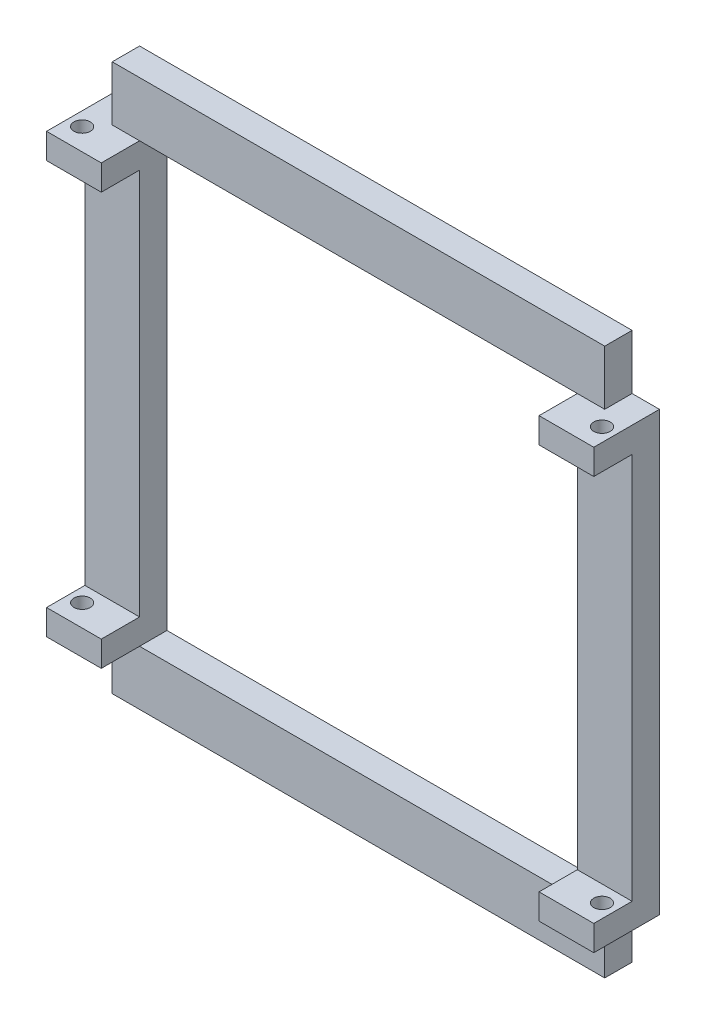
ISO-10303-21;
HEADER;
FILE_DESCRIPTION(('STEP AP214'),'2;1');
FILE_NAME('part.step','',(''),(''),'','','');
FILE_SCHEMA(('AUTOMOTIVE_DESIGN { 1 0 10303 214 1 1 1 1 }'));
ENDSEC;
DATA;
#1=APPLICATION_CONTEXT('core data for automotive mechanical design processes');
#2=APPLICATION_PROTOCOL_DEFINITION('international standard','automotive_design',2000,#1);
#3=PRODUCT_CONTEXT('',#1,'mechanical');
#4=PRODUCT('Part','Part','',(#3));
#5=PRODUCT_RELATED_PRODUCT_CATEGORY('part','',(#4));
#6=PRODUCT_DEFINITION_FORMATION('','',#4);
#7=PRODUCT_DEFINITION_CONTEXT('part definition',#1,'design');
#8=PRODUCT_DEFINITION('design','',#6,#7);
#9=PRODUCT_DEFINITION_SHAPE('','',#8);
#10=(LENGTH_UNIT() NAMED_UNIT(*) SI_UNIT(.MILLI.,.METRE.));
#11=(NAMED_UNIT(*) PLANE_ANGLE_UNIT() SI_UNIT($,.RADIAN.));
#12=(NAMED_UNIT(*) SI_UNIT($,.STERADIAN.) SOLID_ANGLE_UNIT());
#13=UNCERTAINTY_MEASURE_WITH_UNIT(LENGTH_MEASURE(1.E-05),#10,'distance_accuracy_value','');
#14=(GEOMETRIC_REPRESENTATION_CONTEXT(3) GLOBAL_UNCERTAINTY_ASSIGNED_CONTEXT((#13)) GLOBAL_UNIT_ASSIGNED_CONTEXT((#10,
#11,#12)) REPRESENTATION_CONTEXT('',''));
#15=CARTESIAN_POINT('',(0.,0.,0.));
#16=DIRECTION('',(0.,0.,1.));
#17=DIRECTION('',(1.,0.,0.));
#18=AXIS2_PLACEMENT_3D('',#15,#16,#17);
#19=CARTESIAN_POINT('',(0.,0.,5.));
#20=DIRECTION('',(0.,0.,1.));
#21=DIRECTION('',(1.,0.,0.));
#22=AXIS2_PLACEMENT_3D('',#19,#20,#21);
#23=PLANE('',#22);
#24=DIRECTION('',(-1.,0.,0.));
#25=VECTOR('',#24,1.);
#26=CARTESIAN_POINT('',(-40.,40.,5.));
#27=LINE('',#26,#25);
#28=CARTESIAN_POINT('',(40.,40.,5.));
#29=VERTEX_POINT('',#28);
#30=CARTESIAN_POINT('',(-40.,40.0000000000001,5.));
#31=VERTEX_POINT('',#30);
#32=EDGE_CURVE('E488',#29,#31,#27,.T.);
#33=ORIENTED_EDGE('',*,*,#32,.F.);
#34=DIRECTION('',(-1.,0.,0.));
#35=VECTOR('',#34,1.);
#36=CARTESIAN_POINT('',(50.,40.0000000000001,5.));
#37=LINE('',#36,#35);
#38=CARTESIAN_POINT('',(45.,40.0000000000001,5.));
#39=VERTEX_POINT('',#38);
#40=EDGE_CURVE('E231',#39,#29,#37,.T.);
#41=ORIENTED_EDGE('',*,*,#40,.F.);
#42=DIRECTION('',(0.,1.,0.));
#43=VECTOR('',#42,1.);
#44=CARTESIAN_POINT('',(45.,40.0000000000001,5.));
#45=LINE('',#44,#43);
#46=CARTESIAN_POINT('',(45.,50.,5.));
#47=VERTEX_POINT('',#46);
#48=EDGE_CURVE('E245',#39,#47,#45,.T.);
#49=ORIENTED_EDGE('',*,*,#48,.T.);
#50=DIRECTION('',(-1.,0.,0.));
#51=VECTOR('',#50,1.);
#52=CARTESIAN_POINT('',(45.,50.,5.));
#53=LINE('',#52,#51);
#54=CARTESIAN_POINT('',(-45.,50.,5.));
#55=VERTEX_POINT('',#54);
#56=EDGE_CURVE('E250',#47,#55,#53,.T.);
#57=ORIENTED_EDGE('',*,*,#56,.T.);
#58=DIRECTION('',(0.,-1.,0.));
#59=VECTOR('',#58,1.);
#60=CARTESIAN_POINT('',(-45.,40.0000000000001,5.));
#61=LINE('',#60,#59);
#62=CARTESIAN_POINT('',(-45.,40.0000000000001,5.));
#63=VERTEX_POINT('',#62);
#64=EDGE_CURVE('E258',#55,#63,#61,.T.);
#65=ORIENTED_EDGE('',*,*,#64,.T.);
#66=DIRECTION('',(-1.,0.,0.));
#67=VECTOR('',#66,1.);
#68=CARTESIAN_POINT('',(-50.,40.0000000000001,5.));
#69=LINE('',#68,#67);
#70=EDGE_CURVE('E406',#31,#63,#69,.T.);
#71=ORIENTED_EDGE('',*,*,#70,.F.);
#72=EDGE_LOOP('',(#33,#41,#49,#57,#65,#71));
#73=FACE_BOUND('',#72,.T.);
#74=ADVANCED_FACE('F43',(#73),#23,.T.);
#75=DIRECTION('',(0.,1.,0.));
#76=VECTOR('',#75,1.);
#77=CARTESIAN_POINT('',(50.,40.0000000000001,5.));
#78=LINE('',#77,#76);
#79=CARTESIAN_POINT('',(50.,-35.3623650712361,5.));
#80=VERTEX_POINT('',#79);
#81=CARTESIAN_POINT('',(50.,35.3623650712361,5.));
#82=VERTEX_POINT('',#81);
#83=EDGE_CURVE('E237',#80,#82,#78,.T.);
#84=ORIENTED_EDGE('',*,*,#83,.T.);
#85=DIRECTION('',(1.,0.,0.));
#86=VECTOR('',#85,1.);
#87=CARTESIAN_POINT('',(50.,35.3623650712361,5.));
#88=LINE('',#87,#86);
#89=CARTESIAN_POINT('',(40.,35.3623650712361,5.));
#90=VERTEX_POINT('',#89);
#91=EDGE_CURVE('E221',#90,#82,#88,.T.);
#92=ORIENTED_EDGE('',*,*,#91,.F.);
#93=DIRECTION('',(0.,1.,0.));
#94=VECTOR('',#93,1.);
#95=CARTESIAN_POINT('',(40.,40.,5.));
#96=LINE('',#95,#94);
#97=CARTESIAN_POINT('',(40.,-35.3623650712361,5.));
#98=VERTEX_POINT('',#97);
#99=EDGE_CURVE('E485',#98,#90,#96,.T.);
#100=ORIENTED_EDGE('',*,*,#99,.F.);
#101=DIRECTION('',(-1.,0.,0.));
#102=VECTOR('',#101,1.);
#103=CARTESIAN_POINT('',(50.,-35.3623650712361,5.));
#104=LINE('',#103,#102);
#105=EDGE_CURVE('E69',#80,#98,#104,.T.);
#106=ORIENTED_EDGE('',*,*,#105,.F.);
#107=EDGE_LOOP('',(#84,#92,#100,#106));
#108=FACE_BOUND('',#107,.T.);
#109=ADVANCED_FACE('F243',(#108),#23,.T.);
#110=DIRECTION('',(0.,-1.,0.));
#111=VECTOR('',#110,1.);
#112=CARTESIAN_POINT('',(-40.,40.,5.));
#113=LINE('',#112,#111);
#114=CARTESIAN_POINT('',(-40.,35.3623650712361,5.));
#115=VERTEX_POINT('',#114);
#116=CARTESIAN_POINT('',(-40.,-35.3623650712361,5.));
#117=VERTEX_POINT('',#116);
#118=EDGE_CURVE('E493',#115,#117,#113,.T.);
#119=ORIENTED_EDGE('',*,*,#118,.F.);
#120=DIRECTION('',(1.,0.,0.));
#121=VECTOR('',#120,1.);
#122=CARTESIAN_POINT('',(-50.,35.3623650712361,5.));
#123=LINE('',#122,#121);
#124=CARTESIAN_POINT('',(-50.,35.3623650712361,5.));
#125=VERTEX_POINT('',#124);
#126=EDGE_CURVE('E403',#125,#115,#123,.T.);
#127=ORIENTED_EDGE('',*,*,#126,.F.);
#128=DIRECTION('',(0.,-1.,0.));
#129=VECTOR('',#128,1.);
#130=CARTESIAN_POINT('',(-50.,40.0000000000001,5.));
#131=LINE('',#130,#129);
#132=CARTESIAN_POINT('',(-50.,-35.3623650712361,5.));
#133=VERTEX_POINT('',#132);
#134=EDGE_CURVE('E301',#125,#133,#131,.T.);
#135=ORIENTED_EDGE('',*,*,#134,.T.);
#136=DIRECTION('',(-1.,0.,0.));
#137=VECTOR('',#136,1.);
#138=CARTESIAN_POINT('',(-50.,-35.3623650712361,5.));
#139=LINE('',#138,#137);
#140=EDGE_CURVE('E433',#117,#133,#139,.T.);
#141=ORIENTED_EDGE('',*,*,#140,.F.);
#142=EDGE_LOOP('',(#119,#127,#135,#141));
#143=FACE_BOUND('',#142,.T.);
#144=ADVANCED_FACE('F603',(#143),#23,.T.);
#145=DIRECTION('',(1.,0.,0.));
#146=VECTOR('',#145,1.);
#147=CARTESIAN_POINT('',(-40.,-40.,5.));
#148=LINE('',#147,#146);
#149=CARTESIAN_POINT('',(-40.,-40.,5.));
#150=VERTEX_POINT('',#149);
#151=CARTESIAN_POINT('',(40.,-40.,5.));
#152=VERTEX_POINT('',#151);
#153=EDGE_CURVE('E496',#150,#152,#148,.T.);
#154=ORIENTED_EDGE('',*,*,#153,.F.);
#155=DIRECTION('',(1.,0.,0.));
#156=VECTOR('',#155,1.);
#157=CARTESIAN_POINT('',(-50.,-40.0000000000001,5.));
#158=LINE('',#157,#156);
#159=CARTESIAN_POINT('',(-45.,-40.0000000000001,5.));
#160=VERTEX_POINT('',#159);
#161=EDGE_CURVE('E437',#160,#150,#158,.T.);
#162=ORIENTED_EDGE('',*,*,#161,.F.);
#163=DIRECTION('',(0.,-1.,0.));
#164=VECTOR('',#163,1.);
#165=CARTESIAN_POINT('',(-45.,-40.0000000000001,5.));
#166=LINE('',#165,#164);
#167=CARTESIAN_POINT('',(-45.,-50.,5.));
#168=VERTEX_POINT('',#167);
#169=EDGE_CURVE('E529',#160,#168,#166,.T.);
#170=ORIENTED_EDGE('',*,*,#169,.T.);
#171=DIRECTION('',(1.,0.,0.));
#172=VECTOR('',#171,1.);
#173=CARTESIAN_POINT('',(45.,-50.,5.));
#174=LINE('',#173,#172);
#175=CARTESIAN_POINT('',(45.,-50.,5.));
#176=VERTEX_POINT('',#175);
#177=EDGE_CURVE('E252',#168,#176,#174,.T.);
#178=ORIENTED_EDGE('',*,*,#177,.T.);
#179=DIRECTION('',(0.,1.,0.));
#180=VECTOR('',#179,1.);
#181=CARTESIAN_POINT('',(45.,-40.0000000000001,5.));
#182=LINE('',#181,#180);
#183=CARTESIAN_POINT('',(45.,-40.0000000000001,5.));
#184=VERTEX_POINT('',#183);
#185=EDGE_CURVE('E246',#176,#184,#182,.T.);
#186=ORIENTED_EDGE('',*,*,#185,.T.);
#187=DIRECTION('',(1.,0.,0.));
#188=VECTOR('',#187,1.);
#189=CARTESIAN_POINT('',(50.,-40.0000000000001,5.));
#190=LINE('',#189,#188);
#191=EDGE_CURVE('E458',#152,#184,#190,.T.);
#192=ORIENTED_EDGE('',*,*,#191,.F.);
#193=EDGE_LOOP('',(#154,#162,#170,#178,#186,#192));
#194=FACE_BOUND('',#193,.T.);
#195=ADVANCED_FACE('F536',(#194),#23,.T.);
#196=CARTESIAN_POINT('',(0.,0.,0.));
#197=DIRECTION('',(0.,0.,1.));
#198=DIRECTION('',(1.,0.,0.));
#199=AXIS2_PLACEMENT_3D('',#196,#197,#198);
#200=PLANE('',#199);
#201=DIRECTION('',(0.,-1.,0.));
#202=VECTOR('',#201,1.);
#203=CARTESIAN_POINT('',(-50.,40.0000000000001,0.));
#204=LINE('',#203,#202);
#205=CARTESIAN_POINT('',(-50.,40.0000000000001,0.));
#206=VERTEX_POINT('',#205);
#207=CARTESIAN_POINT('',(-50.,-40.0000000000001,0.));
#208=VERTEX_POINT('',#207);
#209=EDGE_CURVE('E263',#206,#208,#204,.T.);
#210=ORIENTED_EDGE('',*,*,#209,.F.);
#211=DIRECTION('',(-1.,0.,0.));
#212=VECTOR('',#211,1.);
#213=CARTESIAN_POINT('',(-50.,40.0000000000001,0.));
#214=LINE('',#213,#212);
#215=CARTESIAN_POINT('',(-45.,40.0000000000001,0.));
#216=VERTEX_POINT('',#215);
#217=EDGE_CURVE('E298',#216,#206,#214,.T.);
#218=ORIENTED_EDGE('',*,*,#217,.F.);
#219=DIRECTION('',(0.,-1.,0.));
#220=VECTOR('',#219,1.);
#221=CARTESIAN_POINT('',(-45.,40.0000000000001,0.));
#222=LINE('',#221,#220);
#223=CARTESIAN_POINT('',(-45.,50.,0.));
#224=VERTEX_POINT('',#223);
#225=EDGE_CURVE('E295',#224,#216,#222,.T.);
#226=ORIENTED_EDGE('',*,*,#225,.F.);
#227=DIRECTION('',(-1.,0.,0.));
#228=VECTOR('',#227,1.);
#229=CARTESIAN_POINT('',(45.,50.,0.));
#230=LINE('',#229,#228);
#231=CARTESIAN_POINT('',(45.,50.,0.));
#232=VERTEX_POINT('',#231);
#233=EDGE_CURVE('E292',#232,#224,#230,.T.);
#234=ORIENTED_EDGE('',*,*,#233,.F.);
#235=DIRECTION('',(0.,1.,0.));
#236=VECTOR('',#235,1.);
#237=CARTESIAN_POINT('',(45.,40.0000000000001,0.));
#238=LINE('',#237,#236);
#239=CARTESIAN_POINT('',(45.,40.0000000000001,0.));
#240=VERTEX_POINT('',#239);
#241=EDGE_CURVE('E289',#240,#232,#238,.T.);
#242=ORIENTED_EDGE('',*,*,#241,.F.);
#243=DIRECTION('',(-1.,0.,0.));
#244=VECTOR('',#243,1.);
#245=CARTESIAN_POINT('',(50.,40.0000000000001,0.));
#246=LINE('',#245,#244);
#247=CARTESIAN_POINT('',(50.,40.0000000000001,0.));
#248=VERTEX_POINT('',#247);
#249=EDGE_CURVE('E286',#248,#240,#246,.T.);
#250=ORIENTED_EDGE('',*,*,#249,.F.);
#251=DIRECTION('',(0.,1.,0.));
#252=VECTOR('',#251,1.);
#253=CARTESIAN_POINT('',(50.,40.0000000000001,0.));
#254=LINE('',#253,#252);
#255=CARTESIAN_POINT('',(50.,-40.0000000000001,0.));
#256=VERTEX_POINT('',#255);
#257=EDGE_CURVE('E283',#256,#248,#254,.T.);
#258=ORIENTED_EDGE('',*,*,#257,.F.);
#259=DIRECTION('',(1.,0.,0.));
#260=VECTOR('',#259,1.);
#261=CARTESIAN_POINT('',(50.,-40.0000000000001,0.));
#262=LINE('',#261,#260);
#263=CARTESIAN_POINT('',(45.,-40.0000000000001,0.));
#264=VERTEX_POINT('',#263);
#265=EDGE_CURVE('E280',#264,#256,#262,.T.);
#266=ORIENTED_EDGE('',*,*,#265,.F.);
#267=DIRECTION('',(0.,1.,0.));
#268=VECTOR('',#267,1.);
#269=CARTESIAN_POINT('',(45.,-40.0000000000001,0.));
#270=LINE('',#269,#268);
#271=CARTESIAN_POINT('',(45.,-50.,0.));
#272=VERTEX_POINT('',#271);
#273=EDGE_CURVE('E277',#272,#264,#270,.T.);
#274=ORIENTED_EDGE('',*,*,#273,.F.);
#275=DIRECTION('',(1.,0.,0.));
#276=VECTOR('',#275,1.);
#277=CARTESIAN_POINT('',(45.,-50.,0.));
#278=LINE('',#277,#276);
#279=CARTESIAN_POINT('',(-45.,-50.,0.));
#280=VERTEX_POINT('',#279);
#281=EDGE_CURVE('E274',#280,#272,#278,.T.);
#282=ORIENTED_EDGE('',*,*,#281,.F.);
#283=DIRECTION('',(0.,-1.,0.));
#284=VECTOR('',#283,1.);
#285=CARTESIAN_POINT('',(-45.,-40.0000000000001,0.));
#286=LINE('',#285,#284);
#287=CARTESIAN_POINT('',(-45.,-40.0000000000001,0.));
#288=VERTEX_POINT('',#287);
#289=EDGE_CURVE('E271',#288,#280,#286,.T.);
#290=ORIENTED_EDGE('',*,*,#289,.F.);
#291=DIRECTION('',(1.,0.,0.));
#292=VECTOR('',#291,1.);
#293=CARTESIAN_POINT('',(-50.,-40.0000000000001,0.));
#294=LINE('',#293,#292);
#295=EDGE_CURVE('E267',#208,#288,#294,.T.);
#296=ORIENTED_EDGE('',*,*,#295,.F.);
#297=EDGE_LOOP('',(#210,#218,#226,#234,#242,#250,#258,#266,#274,#282,#290,#296));
#298=FACE_BOUND('',#297,.T.);
#299=DIRECTION('',(0.,1.,0.));
#300=VECTOR('',#299,1.);
#301=CARTESIAN_POINT('',(40.,40.,0.));
#302=LINE('',#301,#300);
#303=CARTESIAN_POINT('',(40.,-40.,0.));
#304=VERTEX_POINT('',#303);
#305=CARTESIAN_POINT('',(40.,40.,0.));
#306=VERTEX_POINT('',#305);
#307=EDGE_CURVE('E484',#304,#306,#302,.T.);
#308=ORIENTED_EDGE('',*,*,#307,.T.);
#309=DIRECTION('',(-1.,0.,0.));
#310=VECTOR('',#309,1.);
#311=CARTESIAN_POINT('',(-40.,40.,0.));
#312=LINE('',#311,#310);
#313=CARTESIAN_POINT('',(-40.,40.,0.));
#314=VERTEX_POINT('',#313);
#315=EDGE_CURVE('E504',#306,#314,#312,.T.);
#316=ORIENTED_EDGE('',*,*,#315,.T.);
#317=DIRECTION('',(0.,-1.,0.));
#318=VECTOR('',#317,1.);
#319=CARTESIAN_POINT('',(-40.,40.,0.));
#320=LINE('',#319,#318);
#321=CARTESIAN_POINT('',(-40.,-40.,0.));
#322=VERTEX_POINT('',#321);
#323=EDGE_CURVE('E508',#314,#322,#320,.T.);
#324=ORIENTED_EDGE('',*,*,#323,.T.);
#325=DIRECTION('',(1.,0.,0.));
#326=VECTOR('',#325,1.);
#327=CARTESIAN_POINT('',(-40.,-40.,0.));
#328=LINE('',#327,#326);
#329=EDGE_CURVE('E489',#322,#304,#328,.T.);
#330=ORIENTED_EDGE('',*,*,#329,.T.);
#331=EDGE_LOOP('',(#308,#316,#324,#330));
#332=FACE_BOUND('',#331,.T.);
#333=ADVANCED_FACE('F562',(#298,#332),#200,.F.);
#334=CARTESIAN_POINT('',(-50.,40.0000000000001,5.));
#335=DIRECTION('',(1.,0.,0.));
#336=DIRECTION('',(0.,0.,-1.));
#337=AXIS2_PLACEMENT_3D('',#334,#335,#336);
#338=PLANE('',#337);
#339=ORIENTED_EDGE('',*,*,#209,.T.);
#340=DIRECTION('',(0.,0.,-1.));
#341=VECTOR('',#340,1.);
#342=CARTESIAN_POINT('',(-50.,-40.0000000000001,5.));
#343=LINE('',#342,#341);
#344=CARTESIAN_POINT('',(-50.,-40.0000000000001,12.));
#345=VERTEX_POINT('',#344);
#346=EDGE_CURVE('E11',#345,#208,#343,.T.);
#347=ORIENTED_EDGE('',*,*,#346,.F.);
#348=DIRECTION('',(0.,-1.,0.));
#349=VECTOR('',#348,1.);
#350=CARTESIAN_POINT('',(-50.,-40.0000000000001,12.));
#351=LINE('',#350,#349);
#352=CARTESIAN_POINT('',(-50.,-35.3623650712361,12.));
#353=VERTEX_POINT('',#352);
#354=EDGE_CURVE('E438',#353,#345,#351,.T.);
#355=ORIENTED_EDGE('',*,*,#354,.F.);
#356=DIRECTION('',(0.,0.,-1.));
#357=VECTOR('',#356,1.);
#358=CARTESIAN_POINT('',(-50.,-35.3623650712361,12.));
#359=LINE('',#358,#357);
#360=EDGE_CURVE('E428',#353,#133,#359,.T.);
#361=ORIENTED_EDGE('',*,*,#360,.T.);
#362=ORIENTED_EDGE('',*,*,#134,.F.);
#363=DIRECTION('',(0.,0.,-1.));
#364=VECTOR('',#363,1.);
#365=CARTESIAN_POINT('',(-50.,35.3623650712361,12.));
#366=LINE('',#365,#364);
#367=CARTESIAN_POINT('',(-50.,35.3623650712361,12.));
#368=VERTEX_POINT('',#367);
#369=EDGE_CURVE('E383',#368,#125,#366,.T.);
#370=ORIENTED_EDGE('',*,*,#369,.F.);
#371=DIRECTION('',(0.,-1.,0.));
#372=VECTOR('',#371,1.);
#373=CARTESIAN_POINT('',(-50.,40.0000000000001,12.));
#374=LINE('',#373,#372);
#375=CARTESIAN_POINT('',(-50.,40.0000000000001,12.));
#376=VERTEX_POINT('',#375);
#377=EDGE_CURVE('E416',#376,#368,#374,.T.);
#378=ORIENTED_EDGE('',*,*,#377,.F.);
#379=DIRECTION('',(0.,0.,-1.));
#380=VECTOR('',#379,1.);
#381=CARTESIAN_POINT('',(-50.,40.0000000000001,5.));
#382=LINE('',#381,#380);
#383=EDGE_CURVE('E262',#376,#206,#382,.T.);
#384=ORIENTED_EDGE('',*,*,#383,.T.);
#385=EDGE_LOOP('',(#339,#347,#355,#361,#362,#370,#378,#384));
#386=FACE_BOUND('',#385,.T.);
#387=ADVANCED_FACE('F45',(#386),#338,.F.);
#388=CARTESIAN_POINT('',(-50.,-40.0000000000001,5.));
#389=DIRECTION('',(0.,1.,0.));
#390=DIRECTION('',(-1.,0.,0.));
#391=AXIS2_PLACEMENT_3D('',#388,#389,#390);
#392=PLANE('',#391);
#393=CARTESIAN_POINT('',(-47.5,-40.0000000000001,8.));
#394=DIRECTION('',(0.,-1.,0.));
#395=DIRECTION('',(1.,0.,0.));
#396=AXIS2_PLACEMENT_3D('',#393,#394,#395);
#397=CIRCLE('',#396,1.5);
#398=CARTESIAN_POINT('',(-46.,-40.0000000000001,8.));
#399=VERTEX_POINT('',#398);
#400=EDGE_CURVE('E347',#399,#399,#397,.T.);
#401=ORIENTED_EDGE('',*,*,#400,.F.);
#402=EDGE_LOOP('',(#401));
#403=FACE_BOUND('',#402,.T.);
#404=ORIENTED_EDGE('',*,*,#295,.T.);
#405=DIRECTION('',(0.,0.,-1.));
#406=VECTOR('',#405,1.);
#407=CARTESIAN_POINT('',(-45.,-40.0000000000001,5.));
#408=LINE('',#407,#406);
#409=EDGE_CURVE('E53',#160,#288,#408,.T.);
#410=ORIENTED_EDGE('',*,*,#409,.F.);
#411=ORIENTED_EDGE('',*,*,#161,.T.);
#412=DIRECTION('',(0.,0.,-1.));
#413=VECTOR('',#412,1.);
#414=CARTESIAN_POINT('',(-40.,-40.0000000000001,12.));
#415=LINE('',#414,#413);
#416=CARTESIAN_POINT('',(-40.,-40.0000000000001,12.));
#417=VERTEX_POINT('',#416);
#418=EDGE_CURVE('E410',#417,#150,#415,.T.);
#419=ORIENTED_EDGE('',*,*,#418,.F.);
#420=DIRECTION('',(1.,0.,0.));
#421=VECTOR('',#420,1.);
#422=CARTESIAN_POINT('',(-50.,-40.0000000000001,12.));
#423=LINE('',#422,#421);
#424=EDGE_CURVE('E447',#345,#417,#423,.T.);
#425=ORIENTED_EDGE('',*,*,#424,.F.);
#426=ORIENTED_EDGE('',*,*,#346,.T.);
#427=EDGE_LOOP('',(#404,#410,#411,#419,#425,#426));
#428=FACE_BOUND('',#427,.T.);
#429=ADVANCED_FACE('F573',(#403,#428),#392,.F.);
#430=CARTESIAN_POINT('',(-45.,-40.0000000000001,5.));
#431=DIRECTION('',(1.,0.,0.));
#432=DIRECTION('',(0.,0.,-1.));
#433=AXIS2_PLACEMENT_3D('',#430,#431,#432);
#434=PLANE('',#433);
#435=ORIENTED_EDGE('',*,*,#289,.T.);
#436=DIRECTION('',(0.,0.,-1.));
#437=VECTOR('',#436,1.);
#438=CARTESIAN_POINT('',(-45.,-50.,5.));
#439=LINE('',#438,#437);
#440=EDGE_CURVE('E337',#168,#280,#439,.T.);
#441=ORIENTED_EDGE('',*,*,#440,.F.);
#442=ORIENTED_EDGE('',*,*,#169,.F.);
#443=ORIENTED_EDGE('',*,*,#409,.T.);
#444=EDGE_LOOP('',(#435,#441,#442,#443));
#445=FACE_BOUND('',#444,.T.);
#446=ADVANCED_FACE('F576',(#445),#434,.F.);
#447=CARTESIAN_POINT('',(45.,-50.,5.));
#448=DIRECTION('',(0.,1.,0.));
#449=DIRECTION('',(0.,0.,1.));
#450=AXIS2_PLACEMENT_3D('',#447,#448,#449);
#451=PLANE('',#450);
#452=ORIENTED_EDGE('',*,*,#281,.T.);
#453=DIRECTION('',(0.,0.,-1.));
#454=VECTOR('',#453,1.);
#455=CARTESIAN_POINT('',(45.,-50.,5.));
#456=LINE('',#455,#454);
#457=EDGE_CURVE('E333',#176,#272,#456,.T.);
#458=ORIENTED_EDGE('',*,*,#457,.F.);
#459=ORIENTED_EDGE('',*,*,#177,.F.);
#460=ORIENTED_EDGE('',*,*,#440,.T.);
#461=EDGE_LOOP('',(#452,#458,#459,#460));
#462=FACE_BOUND('',#461,.T.);
#463=ADVANCED_FACE('F542',(#462),#451,.F.);
#464=CARTESIAN_POINT('',(45.,-40.0000000000001,5.));
#465=DIRECTION('',(-1.,0.,0.));
#466=DIRECTION('',(0.,0.,1.));
#467=AXIS2_PLACEMENT_3D('',#464,#465,#466);
#468=PLANE('',#467);
#469=ORIENTED_EDGE('',*,*,#273,.T.);
#470=DIRECTION('',(0.,0.,-1.));
#471=VECTOR('',#470,1.);
#472=CARTESIAN_POINT('',(45.,-40.0000000000001,5.));
#473=LINE('',#472,#471);
#474=EDGE_CURVE('E329',#184,#264,#473,.T.);
#475=ORIENTED_EDGE('',*,*,#474,.F.);
#476=ORIENTED_EDGE('',*,*,#185,.F.);
#477=ORIENTED_EDGE('',*,*,#457,.T.);
#478=EDGE_LOOP('',(#469,#475,#476,#477));
#479=FACE_BOUND('',#478,.T.);
#480=ADVANCED_FACE('F546',(#479),#468,.F.);
#481=CARTESIAN_POINT('',(50.,-40.0000000000001,5.));
#482=DIRECTION('',(0.,1.,0.));
#483=DIRECTION('',(-1.,0.,0.));
#484=AXIS2_PLACEMENT_3D('',#481,#482,#483);
#485=PLANE('',#484);
#486=CARTESIAN_POINT('',(47.4999999999999,-40.0000000000002,8.));
#487=DIRECTION('',(0.,-1.,0.));
#488=DIRECTION('',(-1.,0.,0.));
#489=AXIS2_PLACEMENT_3D('',#486,#487,#488);
#490=CIRCLE('',#489,1.5);
#491=CARTESIAN_POINT('',(45.9999999999999,-40.0000000000002,8.));
#492=VERTEX_POINT('',#491);
#493=EDGE_CURVE('E356',#492,#492,#490,.T.);
#494=ORIENTED_EDGE('',*,*,#493,.F.);
#495=EDGE_LOOP('',(#494));
#496=FACE_BOUND('',#495,.T.);
#497=ORIENTED_EDGE('',*,*,#265,.T.);
#498=DIRECTION('',(0.,0.,-1.));
#499=VECTOR('',#498,1.);
#500=CARTESIAN_POINT('',(50.,-40.0000000000001,5.));
#501=LINE('',#500,#499);
#502=CARTESIAN_POINT('',(50.,-40.0000000000001,12.));
#503=VERTEX_POINT('',#502);
#504=EDGE_CURVE('E325',#503,#256,#501,.T.);
#505=ORIENTED_EDGE('',*,*,#504,.F.);
#506=DIRECTION('',(1.,0.,0.));
#507=VECTOR('',#506,1.);
#508=CARTESIAN_POINT('',(50.,-40.0000000000001,12.));
#509=LINE('',#508,#507);
#510=CARTESIAN_POINT('',(40.,-40.0000000000001,12.));
#511=VERTEX_POINT('',#510);
#512=EDGE_CURVE('E464',#511,#503,#509,.T.);
#513=ORIENTED_EDGE('',*,*,#512,.F.);
#514=DIRECTION('',(0.,0.,-1.));
#515=VECTOR('',#514,1.);
#516=CARTESIAN_POINT('',(40.,-40.0000000000001,12.));
#517=LINE('',#516,#515);
#518=EDGE_CURVE('E468',#511,#152,#517,.T.);
#519=ORIENTED_EDGE('',*,*,#518,.T.);
#520=ORIENTED_EDGE('',*,*,#191,.T.);
#521=ORIENTED_EDGE('',*,*,#474,.T.);
#522=EDGE_LOOP('',(#497,#505,#513,#519,#520,#521));
#523=FACE_BOUND('',#522,.T.);
#524=ADVANCED_FACE('F549',(#496,#523),#485,.F.);
#525=CARTESIAN_POINT('',(50.,40.0000000000001,5.));
#526=DIRECTION('',(-1.,0.,0.));
#527=DIRECTION('',(0.,0.,1.));
#528=AXIS2_PLACEMENT_3D('',#525,#526,#527);
#529=PLANE('',#528);
#530=ORIENTED_EDGE('',*,*,#257,.T.);
#531=DIRECTION('',(0.,0.,-1.));
#532=VECTOR('',#531,1.);
#533=CARTESIAN_POINT('',(50.,40.0000000000001,5.));
#534=LINE('',#533,#532);
#535=CARTESIAN_POINT('',(50.,40.0000000000001,12.));
#536=VERTEX_POINT('',#535);
#537=EDGE_CURVE('E321',#536,#248,#534,.T.);
#538=ORIENTED_EDGE('',*,*,#537,.F.);
#539=DIRECTION('',(0.,1.,0.));
#540=VECTOR('',#539,1.);
#541=CARTESIAN_POINT('',(50.,40.0000000000001,12.));
#542=LINE('',#541,#540);
#543=CARTESIAN_POINT('',(50.,35.3623650712361,12.));
#544=VERTEX_POINT('',#543);
#545=EDGE_CURVE('E240',#544,#536,#542,.T.);
#546=ORIENTED_EDGE('',*,*,#545,.F.);
#547=DIRECTION('',(0.,0.,-1.));
#548=VECTOR('',#547,1.);
#549=CARTESIAN_POINT('',(50.,35.3623650712361,12.));
#550=LINE('',#549,#548);
#551=EDGE_CURVE('E225',#544,#82,#550,.T.);
#552=ORIENTED_EDGE('',*,*,#551,.T.);
#553=ORIENTED_EDGE('',*,*,#83,.F.);
#554=DIRECTION('',(0.,0.,-1.));
#555=VECTOR('',#554,1.);
#556=CARTESIAN_POINT('',(50.,-35.3623650712361,12.));
#557=LINE('',#556,#555);
#558=CARTESIAN_POINT('',(50.,-35.3623650712361,12.));
#559=VERTEX_POINT('',#558);
#560=EDGE_CURVE('E481',#559,#80,#557,.T.);
#561=ORIENTED_EDGE('',*,*,#560,.F.);
#562=DIRECTION('',(0.,1.,0.));
#563=VECTOR('',#562,1.);
#564=CARTESIAN_POINT('',(50.,-40.0000000000001,12.));
#565=LINE('',#564,#563);
#566=EDGE_CURVE('E453',#503,#559,#565,.T.);
#567=ORIENTED_EDGE('',*,*,#566,.F.);
#568=ORIENTED_EDGE('',*,*,#504,.T.);
#569=EDGE_LOOP('',(#530,#538,#546,#552,#553,#561,#567,#568));
#570=FACE_BOUND('',#569,.T.);
#571=ADVANCED_FACE('F235',(#570),#529,.F.);
#572=CARTESIAN_POINT('',(50.,40.0000000000001,5.));
#573=DIRECTION('',(0.,-1.,0.));
#574=DIRECTION('',(1.,0.,0.));
#575=AXIS2_PLACEMENT_3D('',#572,#573,#574);
#576=PLANE('',#575);
#577=CARTESIAN_POINT('',(47.5,40.0000000000001,8.));
#578=DIRECTION('',(0.,-1.,0.));
#579=DIRECTION('',(1.,0.,0.));
#580=AXIS2_PLACEMENT_3D('',#577,#578,#579);
#581=CIRCLE('',#580,1.5);
#582=CARTESIAN_POINT('',(49.,40.0000000000001,8.));
#583=VERTEX_POINT('',#582);
#584=EDGE_CURVE('E353',#583,#583,#581,.T.);
#585=ORIENTED_EDGE('',*,*,#584,.T.);
#586=EDGE_LOOP('',(#585));
#587=FACE_BOUND('',#586,.T.);
#588=ORIENTED_EDGE('',*,*,#249,.T.);
#589=DIRECTION('',(0.,0.,-1.));
#590=VECTOR('',#589,1.);
#591=CARTESIAN_POINT('',(45.,40.0000000000001,5.));
#592=LINE('',#591,#590);
#593=EDGE_CURVE('E317',#39,#240,#592,.T.);
#594=ORIENTED_EDGE('',*,*,#593,.F.);
#595=ORIENTED_EDGE('',*,*,#40,.T.);
#596=DIRECTION('',(0.,0.,-1.));
#597=VECTOR('',#596,1.);
#598=CARTESIAN_POINT('',(40.,40.0000000000001,12.));
#599=LINE('',#598,#597);
#600=CARTESIAN_POINT('',(40.,40.0000000000001,12.));
#601=VERTEX_POINT('',#600);
#602=EDGE_CURVE('E375',#601,#29,#599,.T.);
#603=ORIENTED_EDGE('',*,*,#602,.F.);
#604=DIRECTION('',(-1.,0.,0.));
#605=VECTOR('',#604,1.);
#606=CARTESIAN_POINT('',(50.,40.0000000000001,12.));
#607=LINE('',#606,#605);
#608=EDGE_CURVE('E232',#536,#601,#607,.T.);
#609=ORIENTED_EDGE('',*,*,#608,.F.);
#610=ORIENTED_EDGE('',*,*,#537,.T.);
#611=EDGE_LOOP('',(#588,#594,#595,#603,#609,#610));
#612=FACE_BOUND('',#611,.T.);
#613=ADVANCED_FACE('F649',(#587,#612),#576,.F.);
#614=CARTESIAN_POINT('',(45.,40.0000000000001,5.));
#615=DIRECTION('',(-1.,0.,0.));
#616=DIRECTION('',(0.,0.,1.));
#617=AXIS2_PLACEMENT_3D('',#614,#615,#616);
#618=PLANE('',#617);
#619=ORIENTED_EDGE('',*,*,#241,.T.);
#620=DIRECTION('',(0.,0.,-1.));
#621=VECTOR('',#620,1.);
#622=CARTESIAN_POINT('',(45.,50.,5.));
#623=LINE('',#622,#621);
#624=EDGE_CURVE('E313',#47,#232,#623,.T.);
#625=ORIENTED_EDGE('',*,*,#624,.F.);
#626=ORIENTED_EDGE('',*,*,#48,.F.);
#627=ORIENTED_EDGE('',*,*,#593,.T.);
#628=EDGE_LOOP('',(#619,#625,#626,#627));
#629=FACE_BOUND('',#628,.T.);
#630=ADVANCED_FACE('F645',(#629),#618,.F.);
#631=CARTESIAN_POINT('',(45.,50.,5.));
#632=DIRECTION('',(0.,-1.,0.));
#633=DIRECTION('',(0.,0.,-1.));
#634=AXIS2_PLACEMENT_3D('',#631,#632,#633);
#635=PLANE('',#634);
#636=ORIENTED_EDGE('',*,*,#233,.T.);
#637=DIRECTION('',(0.,0.,-1.));
#638=VECTOR('',#637,1.);
#639=CARTESIAN_POINT('',(-45.,50.,5.));
#640=LINE('',#639,#638);
#641=EDGE_CURVE('E309',#55,#224,#640,.T.);
#642=ORIENTED_EDGE('',*,*,#641,.F.);
#643=ORIENTED_EDGE('',*,*,#56,.F.);
#644=ORIENTED_EDGE('',*,*,#624,.T.);
#645=EDGE_LOOP('',(#636,#642,#643,#644));
#646=FACE_BOUND('',#645,.T.);
#647=ADVANCED_FACE('F641',(#646),#635,.F.);
#648=CARTESIAN_POINT('',(-45.,40.0000000000001,5.));
#649=DIRECTION('',(1.,0.,0.));
#650=DIRECTION('',(0.,0.,-1.));
#651=AXIS2_PLACEMENT_3D('',#648,#649,#650);
#652=PLANE('',#651);
#653=ORIENTED_EDGE('',*,*,#225,.T.);
#654=DIRECTION('',(0.,0.,-1.));
#655=VECTOR('',#654,1.);
#656=CARTESIAN_POINT('',(-45.,40.0000000000001,5.));
#657=LINE('',#656,#655);
#658=EDGE_CURVE('E305',#63,#216,#657,.T.);
#659=ORIENTED_EDGE('',*,*,#658,.F.);
#660=ORIENTED_EDGE('',*,*,#64,.F.);
#661=ORIENTED_EDGE('',*,*,#641,.T.);
#662=EDGE_LOOP('',(#653,#659,#660,#661));
#663=FACE_BOUND('',#662,.T.);
#664=ADVANCED_FACE('F637',(#663),#652,.F.);
#665=CARTESIAN_POINT('',(-50.,40.0000000000001,5.));
#666=DIRECTION('',(0.,-1.,0.));
#667=DIRECTION('',(1.,0.,0.));
#668=AXIS2_PLACEMENT_3D('',#665,#666,#667);
#669=PLANE('',#668);
#670=CARTESIAN_POINT('',(-47.4999999999999,40.0000000000001,8.));
#671=DIRECTION('',(0.,-1.,0.));
#672=DIRECTION('',(1.,0.,0.));
#673=AXIS2_PLACEMENT_3D('',#670,#671,#672);
#674=CIRCLE('',#673,1.5);
#675=CARTESIAN_POINT('',(-45.9999999999999,40.0000000000001,8.));
#676=VERTEX_POINT('',#675);
#677=EDGE_CURVE('E371',#676,#676,#674,.T.);
#678=ORIENTED_EDGE('',*,*,#677,.T.);
#679=EDGE_LOOP('',(#678));
#680=FACE_BOUND('',#679,.T.);
#681=ORIENTED_EDGE('',*,*,#217,.T.);
#682=ORIENTED_EDGE('',*,*,#383,.F.);
#683=DIRECTION('',(-1.,0.,0.));
#684=VECTOR('',#683,1.);
#685=CARTESIAN_POINT('',(-50.,40.0000000000001,12.));
#686=LINE('',#685,#684);
#687=CARTESIAN_POINT('',(-40.,40.0000000000001,12.));
#688=VERTEX_POINT('',#687);
#689=EDGE_CURVE('E407',#688,#376,#686,.T.);
#690=ORIENTED_EDGE('',*,*,#689,.F.);
#691=DIRECTION('',(0.,0.,-1.));
#692=VECTOR('',#691,1.);
#693=CARTESIAN_POINT('',(-40.,40.0000000000001,12.));
#694=LINE('',#693,#692);
#695=EDGE_CURVE('E399',#688,#31,#694,.T.);
#696=ORIENTED_EDGE('',*,*,#695,.T.);
#697=ORIENTED_EDGE('',*,*,#70,.T.);
#698=ORIENTED_EDGE('',*,*,#658,.T.);
#699=EDGE_LOOP('',(#681,#682,#690,#696,#697,#698));
#700=FACE_BOUND('',#699,.T.);
#701=ADVANCED_FACE('F631',(#680,#700),#669,.F.);
#702=CARTESIAN_POINT('',(40.,40.,5.));
#703=DIRECTION('',(-1.,0.,0.));
#704=DIRECTION('',(0.,-1.,0.));
#705=AXIS2_PLACEMENT_3D('',#702,#703,#704);
#706=PLANE('',#705);
#707=ORIENTED_EDGE('',*,*,#307,.F.);
#708=DIRECTION('',(0.,0.,-1.));
#709=VECTOR('',#708,1.);
#710=CARTESIAN_POINT('',(40.,-40.,5.));
#711=LINE('',#710,#709);
#712=EDGE_CURVE('E500',#152,#304,#711,.T.);
#713=ORIENTED_EDGE('',*,*,#712,.F.);
#714=ORIENTED_EDGE('',*,*,#518,.F.);
#715=DIRECTION('',(0.,-1.,0.));
#716=VECTOR('',#715,1.);
#717=CARTESIAN_POINT('',(40.,-40.0000000000001,12.));
#718=LINE('',#717,#716);
#719=CARTESIAN_POINT('',(40.,-35.3623650712361,12.));
#720=VERTEX_POINT('',#719);
#721=EDGE_CURVE('E461',#720,#511,#718,.T.);
#722=ORIENTED_EDGE('',*,*,#721,.F.);
#723=DIRECTION('',(0.,0.,-1.));
#724=VECTOR('',#723,1.);
#725=CARTESIAN_POINT('',(40.,-35.3623650712361,12.));
#726=LINE('',#725,#724);
#727=EDGE_CURVE('E477',#720,#98,#726,.T.);
#728=ORIENTED_EDGE('',*,*,#727,.T.);
#729=ORIENTED_EDGE('',*,*,#99,.T.);
#730=DIRECTION('',(0.,0.,-1.));
#731=VECTOR('',#730,1.);
#732=CARTESIAN_POINT('',(40.,35.3623650712361,12.));
#733=LINE('',#732,#731);
#734=CARTESIAN_POINT('',(40.,35.3623650712361,12.));
#735=VERTEX_POINT('',#734);
#736=EDGE_CURVE('E228',#735,#90,#733,.T.);
#737=ORIENTED_EDGE('',*,*,#736,.F.);
#738=DIRECTION('',(0.,-1.,0.));
#739=VECTOR('',#738,1.);
#740=CARTESIAN_POINT('',(40.,40.0000000000001,12.));
#741=LINE('',#740,#739);
#742=EDGE_CURVE('E389',#601,#735,#741,.T.);
#743=ORIENTED_EDGE('',*,*,#742,.F.);
#744=ORIENTED_EDGE('',*,*,#602,.T.);
#745=DIRECTION('',(0.,0.,-1.));
#746=VECTOR('',#745,1.);
#747=CARTESIAN_POINT('',(40.,40.,5.));
#748=LINE('',#747,#746);
#749=EDGE_CURVE('E268',#29,#306,#748,.T.);
#750=ORIENTED_EDGE('',*,*,#749,.T.);
#751=EDGE_LOOP('',(#707,#713,#714,#722,#728,#729,#737,#743,#744,#750));
#752=FACE_BOUND('',#751,.T.);
#753=ADVANCED_FACE('F558',(#752),#706,.T.);
#754=CARTESIAN_POINT('',(-40.,40.,5.));
#755=DIRECTION('',(0.,-1.,0.));
#756=DIRECTION('',(0.,0.,-1.));
#757=AXIS2_PLACEMENT_3D('',#754,#755,#756);
#758=PLANE('',#757);
#759=ORIENTED_EDGE('',*,*,#315,.F.);
#760=ORIENTED_EDGE('',*,*,#749,.F.);
#761=ORIENTED_EDGE('',*,*,#32,.T.);
#762=DIRECTION('',(0.,0.,-1.));
#763=VECTOR('',#762,1.);
#764=CARTESIAN_POINT('',(-40.,40.,5.));
#765=LINE('',#764,#763);
#766=EDGE_CURVE('E521',#31,#314,#765,.T.);
#767=ORIENTED_EDGE('',*,*,#766,.T.);
#768=EDGE_LOOP('',(#759,#760,#761,#767));
#769=FACE_BOUND('',#768,.T.);
#770=ADVANCED_FACE('F812',(#769),#758,.T.);
#771=CARTESIAN_POINT('',(-40.,40.,5.));
#772=DIRECTION('',(1.,0.,0.));
#773=DIRECTION('',(0.,1.,0.));
#774=AXIS2_PLACEMENT_3D('',#771,#772,#773);
#775=PLANE('',#774);
#776=ORIENTED_EDGE('',*,*,#323,.F.);
#777=ORIENTED_EDGE('',*,*,#766,.F.);
#778=ORIENTED_EDGE('',*,*,#695,.F.);
#779=DIRECTION('',(0.,1.,0.));
#780=VECTOR('',#779,1.);
#781=CARTESIAN_POINT('',(-40.,40.0000000000001,12.));
#782=LINE('',#781,#780);
#783=CARTESIAN_POINT('',(-40.,35.3623650712361,12.));
#784=VERTEX_POINT('',#783);
#785=EDGE_CURVE('E402',#784,#688,#782,.T.);
#786=ORIENTED_EDGE('',*,*,#785,.F.);
#787=DIRECTION('',(0.,0.,-1.));
#788=VECTOR('',#787,1.);
#789=CARTESIAN_POINT('',(-40.,35.3623650712361,12.));
#790=LINE('',#789,#788);
#791=EDGE_CURVE('E61',#784,#115,#790,.T.);
#792=ORIENTED_EDGE('',*,*,#791,.T.);
#793=ORIENTED_EDGE('',*,*,#118,.T.);
#794=DIRECTION('',(0.,0.,-1.));
#795=VECTOR('',#794,1.);
#796=CARTESIAN_POINT('',(-40.,-35.3623650712361,12.));
#797=LINE('',#796,#795);
#798=CARTESIAN_POINT('',(-40.,-35.3623650712361,12.));
#799=VERTEX_POINT('',#798);
#800=EDGE_CURVE('E424',#799,#117,#797,.T.);
#801=ORIENTED_EDGE('',*,*,#800,.F.);
#802=DIRECTION('',(0.,1.,0.));
#803=VECTOR('',#802,1.);
#804=CARTESIAN_POINT('',(-40.,-40.0000000000001,12.));
#805=LINE('',#804,#803);
#806=EDGE_CURVE('E444',#417,#799,#805,.T.);
#807=ORIENTED_EDGE('',*,*,#806,.F.);
#808=ORIENTED_EDGE('',*,*,#418,.T.);
#809=DIRECTION('',(0.,0.,-1.));
#810=VECTOR('',#809,1.);
#811=CARTESIAN_POINT('',(-40.,-40.,5.));
#812=LINE('',#811,#810);
#813=EDGE_CURVE('E518',#150,#322,#812,.T.);
#814=ORIENTED_EDGE('',*,*,#813,.T.);
#815=EDGE_LOOP('',(#776,#777,#778,#786,#792,#793,#801,#807,#808,#814));
#816=FACE_BOUND('',#815,.T.);
#817=ADVANCED_FACE('F565',(#816),#775,.T.);
#818=CARTESIAN_POINT('',(-40.,-40.,5.));
#819=DIRECTION('',(0.,1.,0.));
#820=DIRECTION('',(0.,0.,1.));
#821=AXIS2_PLACEMENT_3D('',#818,#819,#820);
#822=PLANE('',#821);
#823=ORIENTED_EDGE('',*,*,#329,.F.);
#824=ORIENTED_EDGE('',*,*,#813,.F.);
#825=ORIENTED_EDGE('',*,*,#153,.T.);
#826=ORIENTED_EDGE('',*,*,#712,.T.);
#827=EDGE_LOOP('',(#823,#824,#825,#826));
#828=FACE_BOUND('',#827,.T.);
#829=ADVANCED_FACE('F556',(#828),#822,.T.);
#830=CARTESIAN_POINT('',(50.,-35.3623650712361,12.));
#831=DIRECTION('',(0.,-1.,0.));
#832=DIRECTION('',(0.,0.,-1.));
#833=AXIS2_PLACEMENT_3D('',#830,#831,#832);
#834=PLANE('',#833);
#835=CARTESIAN_POINT('',(47.4999999999999,-35.3623650712361,8.));
#836=DIRECTION('',(0.,-1.,0.));
#837=DIRECTION('',(0.,0.,-1.));
#838=AXIS2_PLACEMENT_3D('',#835,#836,#837);
#839=CIRCLE('',#838,1.5);
#840=CARTESIAN_POINT('',(47.4999999999999,-35.3623650712361,6.5));
#841=VERTEX_POINT('',#840);
#842=EDGE_CURVE('E346',#841,#841,#839,.T.);
#843=ORIENTED_EDGE('',*,*,#842,.T.);
#844=EDGE_LOOP('',(#843));
#845=FACE_BOUND('',#844,.T.);
#846=ORIENTED_EDGE('',*,*,#105,.T.);
#847=ORIENTED_EDGE('',*,*,#727,.F.);
#848=DIRECTION('',(-1.,0.,0.));
#849=VECTOR('',#848,1.);
#850=CARTESIAN_POINT('',(50.,-35.3623650712361,12.));
#851=LINE('',#850,#849);
#852=EDGE_CURVE('E457',#559,#720,#851,.T.);
#853=ORIENTED_EDGE('',*,*,#852,.F.);
#854=ORIENTED_EDGE('',*,*,#560,.T.);
#855=EDGE_LOOP('',(#846,#847,#853,#854));
#856=FACE_BOUND('',#855,.T.);
#857=ADVANCED_FACE('F586',(#845,#856),#834,.F.);
#858=CARTESIAN_POINT('',(0.,0.,12.));
#859=DIRECTION('',(0.,0.,1.));
#860=DIRECTION('',(1.,0.,0.));
#861=AXIS2_PLACEMENT_3D('',#858,#859,#860);
#862=PLANE('',#861);
#863=ORIENTED_EDGE('',*,*,#566,.T.);
#864=ORIENTED_EDGE('',*,*,#852,.T.);
#865=ORIENTED_EDGE('',*,*,#721,.T.);
#866=ORIENTED_EDGE('',*,*,#512,.T.);
#867=EDGE_LOOP('',(#863,#864,#865,#866));
#868=FACE_BOUND('',#867,.T.);
#869=ADVANCED_FACE('F583',(#868),#862,.T.);
#870=CARTESIAN_POINT('',(-50.,-35.3623650712361,12.));
#871=DIRECTION('',(0.,-1.,0.));
#872=DIRECTION('',(0.,0.,-1.));
#873=AXIS2_PLACEMENT_3D('',#870,#871,#872);
#874=PLANE('',#873);
#875=CARTESIAN_POINT('',(-47.5,-35.3623650712361,8.));
#876=DIRECTION('',(0.,-1.,0.));
#877=DIRECTION('',(0.,0.,-1.));
#878=AXIS2_PLACEMENT_3D('',#875,#876,#877);
#879=CIRCLE('',#878,1.5);
#880=CARTESIAN_POINT('',(-47.5,-35.3623650712361,6.5));
#881=VERTEX_POINT('',#880);
#882=EDGE_CURVE('E367',#881,#881,#879,.T.);
#883=ORIENTED_EDGE('',*,*,#882,.T.);
#884=EDGE_LOOP('',(#883));
#885=FACE_BOUND('',#884,.T.);
#886=ORIENTED_EDGE('',*,*,#140,.T.);
#887=ORIENTED_EDGE('',*,*,#360,.F.);
#888=DIRECTION('',(-1.,0.,0.));
#889=VECTOR('',#888,1.);
#890=CARTESIAN_POINT('',(-50.,-35.3623650712361,12.));
#891=LINE('',#890,#889);
#892=EDGE_CURVE('E432',#799,#353,#891,.T.);
#893=ORIENTED_EDGE('',*,*,#892,.F.);
#894=ORIENTED_EDGE('',*,*,#800,.T.);
#895=EDGE_LOOP('',(#886,#887,#893,#894));
#896=FACE_BOUND('',#895,.T.);
#897=ADVANCED_FACE('F594',(#885,#896),#874,.F.);
#898=CARTESIAN_POINT('',(0.,0.,12.));
#899=DIRECTION('',(0.,0.,-1.));
#900=DIRECTION('',(-1.,0.,0.));
#901=AXIS2_PLACEMENT_3D('',#898,#899,#900);
#902=PLANE('',#901);
#903=ORIENTED_EDGE('',*,*,#354,.T.);
#904=ORIENTED_EDGE('',*,*,#424,.T.);
#905=ORIENTED_EDGE('',*,*,#806,.T.);
#906=ORIENTED_EDGE('',*,*,#892,.T.);
#907=EDGE_LOOP('',(#903,#904,#905,#906));
#908=FACE_BOUND('',#907,.T.);
#909=ADVANCED_FACE('F624',(#908),#902,.F.);
#910=CARTESIAN_POINT('',(-50.,35.3623650712361,12.));
#911=DIRECTION('',(0.,1.,0.));
#912=DIRECTION('',(0.,0.,1.));
#913=AXIS2_PLACEMENT_3D('',#910,#911,#912);
#914=PLANE('',#913);
#915=CARTESIAN_POINT('',(-47.4999999999999,35.3623650712361,8.));
#916=DIRECTION('',(0.,1.,0.));
#917=DIRECTION('',(0.,0.,1.));
#918=AXIS2_PLACEMENT_3D('',#915,#916,#917);
#919=CIRCLE('',#918,1.5);
#920=CARTESIAN_POINT('',(-47.4999999999999,35.3623650712361,9.50000000000001));
#921=VERTEX_POINT('',#920);
#922=EDGE_CURVE('E47',#921,#921,#919,.T.);
#923=ORIENTED_EDGE('',*,*,#922,.T.);
#924=EDGE_LOOP('',(#923));
#925=FACE_BOUND('',#924,.T.);
#926=ORIENTED_EDGE('',*,*,#126,.T.);
#927=ORIENTED_EDGE('',*,*,#791,.F.);
#928=DIRECTION('',(1.,0.,0.));
#929=VECTOR('',#928,1.);
#930=CARTESIAN_POINT('',(-50.,35.3623650712361,12.));
#931=LINE('',#930,#929);
#932=EDGE_CURVE('E413',#368,#784,#931,.T.);
#933=ORIENTED_EDGE('',*,*,#932,.F.);
#934=ORIENTED_EDGE('',*,*,#369,.T.);
#935=EDGE_LOOP('',(#926,#927,#933,#934));
#936=FACE_BOUND('',#935,.T.);
#937=ADVANCED_FACE('F668',(#925,#936),#914,.F.);
#938=CARTESIAN_POINT('',(0.,0.,12.));
#939=DIRECTION('',(0.,0.,-1.));
#940=DIRECTION('',(-1.,0.,0.));
#941=AXIS2_PLACEMENT_3D('',#938,#939,#940);
#942=PLANE('',#941);
#943=ORIENTED_EDGE('',*,*,#689,.T.);
#944=ORIENTED_EDGE('',*,*,#377,.T.);
#945=ORIENTED_EDGE('',*,*,#932,.T.);
#946=ORIENTED_EDGE('',*,*,#785,.T.);
#947=EDGE_LOOP('',(#943,#944,#945,#946));
#948=FACE_BOUND('',#947,.T.);
#949=ADVANCED_FACE('F665',(#948),#942,.F.);
#950=CARTESIAN_POINT('',(50.,35.3623650712361,12.));
#951=DIRECTION('',(0.,1.,0.));
#952=DIRECTION('',(0.,0.,1.));
#953=AXIS2_PLACEMENT_3D('',#950,#951,#952);
#954=PLANE('',#953);
#955=CARTESIAN_POINT('',(47.5,35.3623650712361,8.));
#956=DIRECTION('',(0.,1.,0.));
#957=DIRECTION('',(0.,0.,1.));
#958=AXIS2_PLACEMENT_3D('',#955,#956,#957);
#959=CIRCLE('',#958,1.5);
#960=CARTESIAN_POINT('',(47.5,35.3623650712361,9.50000000000001));
#961=VERTEX_POINT('',#960);
#962=EDGE_CURVE('E343',#961,#961,#959,.T.);
#963=ORIENTED_EDGE('',*,*,#962,.T.);
#964=EDGE_LOOP('',(#963));
#965=FACE_BOUND('',#964,.T.);
#966=ORIENTED_EDGE('',*,*,#91,.T.);
#967=ORIENTED_EDGE('',*,*,#551,.F.);
#968=DIRECTION('',(1.,0.,0.));
#969=VECTOR('',#968,1.);
#970=CARTESIAN_POINT('',(50.,35.3623650712361,12.));
#971=LINE('',#970,#969);
#972=EDGE_CURVE('E386',#735,#544,#971,.T.);
#973=ORIENTED_EDGE('',*,*,#972,.F.);
#974=ORIENTED_EDGE('',*,*,#736,.T.);
#975=EDGE_LOOP('',(#966,#967,#973,#974));
#976=FACE_BOUND('',#975,.T.);
#977=ADVANCED_FACE('F223',(#965,#976),#954,.F.);
#978=CARTESIAN_POINT('',(0.,0.,12.));
#979=DIRECTION('',(0.,0.,1.));
#980=DIRECTION('',(1.,0.,0.));
#981=AXIS2_PLACEMENT_3D('',#978,#979,#980);
#982=PLANE('',#981);
#983=ORIENTED_EDGE('',*,*,#608,.T.);
#984=ORIENTED_EDGE('',*,*,#742,.T.);
#985=ORIENTED_EDGE('',*,*,#972,.T.);
#986=ORIENTED_EDGE('',*,*,#545,.T.);
#987=EDGE_LOOP('',(#983,#984,#985,#986));
#988=FACE_BOUND('',#987,.T.);
#989=ADVANCED_FACE('F653',(#988),#982,.T.);
#990=CARTESIAN_POINT('',(47.5,50.,8.));
#991=DIRECTION('',(0.,-1.,0.));
#992=DIRECTION('',(1.,0.,0.));
#993=AXIS2_PLACEMENT_3D('',#990,#991,#992);
#994=CYLINDRICAL_SURFACE('',#993,1.5);
#995=ORIENTED_EDGE('',*,*,#962,.F.);
#996=EDGE_LOOP('',(#995));
#997=FACE_BOUND('',#996,.T.);
#998=ORIENTED_EDGE('',*,*,#584,.F.);
#999=EDGE_LOOP('',(#998));
#1000=FACE_BOUND('',#999,.T.);
#1001=ADVANCED_FACE('F655',(#997,#1000),#994,.F.);
#1002=CARTESIAN_POINT('',(-47.4999999999999,50.0000000000001,8.));
#1003=DIRECTION('',(0.,-1.,0.));
#1004=DIRECTION('',(1.,0.,0.));
#1005=AXIS2_PLACEMENT_3D('',#1002,#1003,#1004);
#1006=CYLINDRICAL_SURFACE('',#1005,1.5);
#1007=ORIENTED_EDGE('',*,*,#922,.F.);
#1008=EDGE_LOOP('',(#1007));
#1009=FACE_BOUND('',#1008,.T.);
#1010=ORIENTED_EDGE('',*,*,#677,.F.);
#1011=EDGE_LOOP('',(#1010));
#1012=FACE_BOUND('',#1011,.T.);
#1013=ADVANCED_FACE('F661',(#1009,#1012),#1006,.F.);
#1014=ORIENTED_EDGE('',*,*,#400,.T.);
#1015=EDGE_LOOP('',(#1014));
#1016=FACE_BOUND('',#1015,.T.);
#1017=ORIENTED_EDGE('',*,*,#882,.F.);
#1018=EDGE_LOOP('',(#1017));
#1019=FACE_BOUND('',#1018,.T.);
#1020=ADVANCED_FACE('F714',(#1016,#1019),#1006,.F.);
#1021=ORIENTED_EDGE('',*,*,#493,.T.);
#1022=EDGE_LOOP('',(#1021));
#1023=FACE_BOUND('',#1022,.T.);
#1024=ORIENTED_EDGE('',*,*,#842,.F.);
#1025=EDGE_LOOP('',(#1024));
#1026=FACE_BOUND('',#1025,.T.);
#1027=ADVANCED_FACE('F664',(#1023,#1026),#994,.F.);
#1028=CLOSED_SHELL('',(#74,#109,#144,#195,#333,#387,#429,#446,#463,#480,#524,#571,#613,#630,
#647,#664,#701,#753,#770,#817,#829,#857,#869,#897,#909,#937,#949,#977,#989,#1001,#1013,#1020,#1027));
#1029=MANIFOLD_SOLID_BREP('B2',#1028);
#1030=ADVANCED_BREP_SHAPE_REPRESENTATION('',(#18,#1029),#14);
#1031=SHAPE_DEFINITION_REPRESENTATION(#9,#1030);
ENDSEC;
END-ISO-10303-21;
